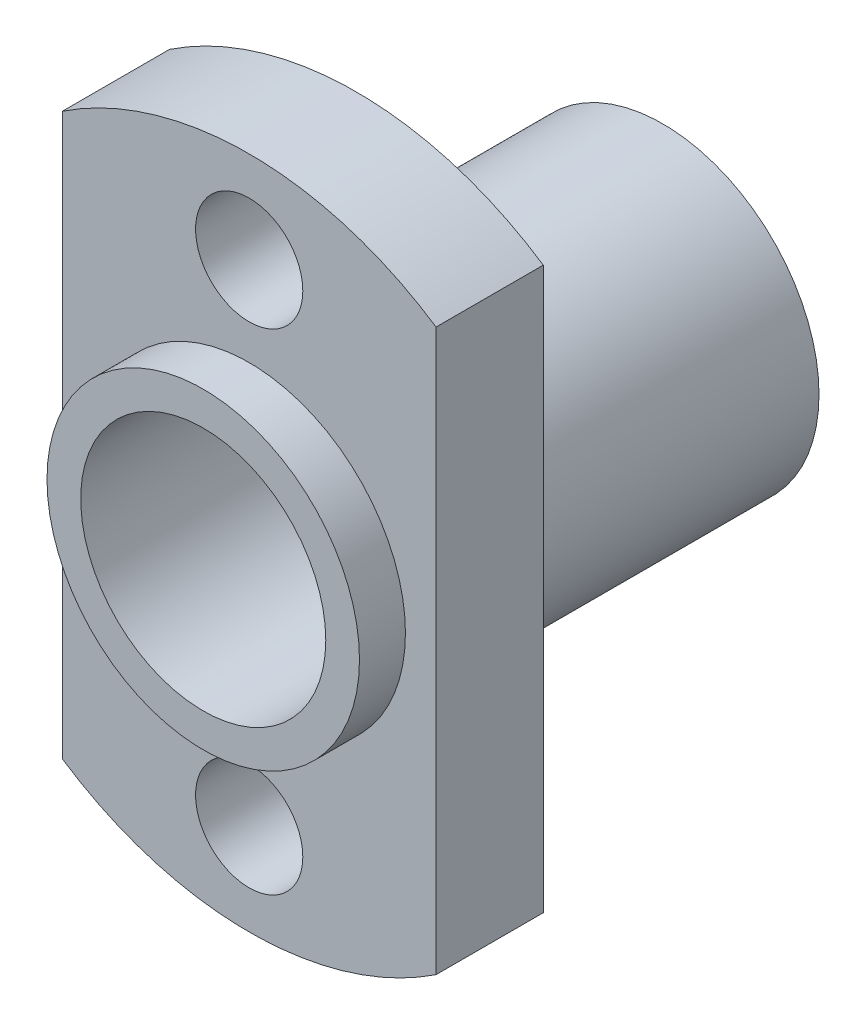
ISO-10303-21;
HEADER;
FILE_DESCRIPTION(('STEP AP214'),'2;1');
FILE_NAME('part.step','',(''),(''),'','','');
FILE_SCHEMA(('AUTOMOTIVE_DESIGN { 1 0 10303 214 1 1 1 1 }'));
ENDSEC;
DATA;
#1=APPLICATION_CONTEXT('core data for automotive mechanical design processes');
#2=APPLICATION_PROTOCOL_DEFINITION('international standard','automotive_design',2000,#1);
#3=PRODUCT_CONTEXT('',#1,'mechanical');
#4=PRODUCT('Part','Part','',(#3));
#5=PRODUCT_RELATED_PRODUCT_CATEGORY('part','',(#4));
#6=PRODUCT_DEFINITION_FORMATION('','',#4);
#7=PRODUCT_DEFINITION_CONTEXT('part definition',#1,'design');
#8=PRODUCT_DEFINITION('design','',#6,#7);
#9=PRODUCT_DEFINITION_SHAPE('','',#8);
#10=(LENGTH_UNIT() NAMED_UNIT(*) SI_UNIT(.MILLI.,.METRE.));
#11=(NAMED_UNIT(*) PLANE_ANGLE_UNIT() SI_UNIT($,.RADIAN.));
#12=(NAMED_UNIT(*) SI_UNIT($,.STERADIAN.) SOLID_ANGLE_UNIT());
#13=UNCERTAINTY_MEASURE_WITH_UNIT(LENGTH_MEASURE(1.E-05),#10,'distance_accuracy_value','');
#14=(GEOMETRIC_REPRESENTATION_CONTEXT(3) GLOBAL_UNCERTAINTY_ASSIGNED_CONTEXT((#13)) GLOBAL_UNIT_ASSIGNED_CONTEXT((#10,
#11,#12)) REPRESENTATION_CONTEXT('',''));
#15=CARTESIAN_POINT('',(0.,0.,0.));
#16=DIRECTION('',(0.,0.,1.));
#17=DIRECTION('',(1.,0.,0.));
#18=AXIS2_PLACEMENT_3D('',#15,#16,#17);
#19=CARTESIAN_POINT('',(0.,0.,-3.5));
#20=DIRECTION('',(0.,0.,1.));
#21=DIRECTION('',(1.,0.,0.));
#22=AXIS2_PLACEMENT_3D('',#19,#20,#21);
#23=CYLINDRICAL_SURFACE('',#22,11.);
#24=CARTESIAN_POINT('',(0.,0.,0.));
#25=DIRECTION('',(0.,0.,1.));
#26=DIRECTION('',(1.,0.,0.));
#27=AXIS2_PLACEMENT_3D('',#24,#25,#26);
#28=CIRCLE('',#27,11.);
#29=CARTESIAN_POINT('',(-6.1,-9.15368778143541,0.));
#30=VERTEX_POINT('',#29);
#31=CARTESIAN_POINT('',(6.1,-9.15368778143541,0.));
#32=VERTEX_POINT('',#31);
#33=EDGE_CURVE('E97',#30,#32,#28,.T.);
#34=ORIENTED_EDGE('',*,*,#33,.F.);
#35=DIRECTION('',(0.,0.,1.));
#36=VECTOR('',#35,1.);
#37=CARTESIAN_POINT('',(-6.1,-9.15368778143541,-3.5));
#38=LINE('',#37,#36);
#39=CARTESIAN_POINT('',(-6.1,-9.15368778143541,-3.5));
#40=VERTEX_POINT('',#39);
#41=EDGE_CURVE('E11',#40,#30,#38,.T.);
#42=ORIENTED_EDGE('',*,*,#41,.F.);
#43=CARTESIAN_POINT('',(0.,0.,-3.5));
#44=DIRECTION('',(0.,0.,1.));
#45=DIRECTION('',(1.,0.,0.));
#46=AXIS2_PLACEMENT_3D('',#43,#44,#45);
#47=CIRCLE('',#46,11.);
#48=CARTESIAN_POINT('',(6.1,-9.15368778143541,-3.5));
#49=VERTEX_POINT('',#48);
#50=EDGE_CURVE('E90',#40,#49,#47,.T.);
#51=ORIENTED_EDGE('',*,*,#50,.T.);
#52=DIRECTION('',(0.,0.,1.));
#53=VECTOR('',#52,1.);
#54=CARTESIAN_POINT('',(6.1,-9.15368778143541,-3.5));
#55=LINE('',#54,#53);
#56=EDGE_CURVE('E35',#49,#32,#55,.T.);
#57=ORIENTED_EDGE('',*,*,#56,.T.);
#58=EDGE_LOOP('',(#34,#42,#51,#57));
#59=FACE_BOUND('',#58,.T.);
#60=ADVANCED_FACE('F32',(#59),#23,.T.);
#61=CARTESIAN_POINT('',(-6.1,-9.15368778143541,-3.5));
#62=DIRECTION('',(-1.,0.,0.));
#63=DIRECTION('',(0.,0.,1.));
#64=AXIS2_PLACEMENT_3D('',#61,#62,#63);
#65=PLANE('',#64);
#66=DIRECTION('',(0.,-1.,0.));
#67=VECTOR('',#66,1.);
#68=CARTESIAN_POINT('',(-6.1,-9.15368778143541,0.));
#69=LINE('',#68,#67);
#70=CARTESIAN_POINT('',(-6.1,9.15368778143541,0.));
#71=VERTEX_POINT('',#70);
#72=EDGE_CURVE('E92',#71,#30,#69,.T.);
#73=ORIENTED_EDGE('',*,*,#72,.F.);
#74=DIRECTION('',(0.,0.,1.));
#75=VECTOR('',#74,1.);
#76=CARTESIAN_POINT('',(-6.1,9.15368778143541,-3.5));
#77=LINE('',#76,#75);
#78=CARTESIAN_POINT('',(-6.1,9.15368778143541,-3.5));
#79=VERTEX_POINT('',#78);
#80=EDGE_CURVE('E41',#79,#71,#77,.T.);
#81=ORIENTED_EDGE('',*,*,#80,.F.);
#82=DIRECTION('',(0.,-1.,0.));
#83=VECTOR('',#82,1.);
#84=CARTESIAN_POINT('',(-6.1,-9.15368778143541,-3.5));
#85=LINE('',#84,#83);
#86=EDGE_CURVE('E87',#79,#40,#85,.T.);
#87=ORIENTED_EDGE('',*,*,#86,.T.);
#88=ORIENTED_EDGE('',*,*,#41,.T.);
#89=EDGE_LOOP('',(#73,#81,#87,#88));
#90=FACE_BOUND('',#89,.T.);
#91=ADVANCED_FACE('F108',(#90),#65,.T.);
#92=CARTESIAN_POINT('',(0.,0.,-3.5));
#93=DIRECTION('',(0.,0.,1.));
#94=DIRECTION('',(1.,0.,0.));
#95=AXIS2_PLACEMENT_3D('',#92,#93,#94);
#96=CYLINDRICAL_SURFACE('',#95,11.);
#97=CARTESIAN_POINT('',(0.,0.,0.));
#98=DIRECTION('',(0.,0.,1.));
#99=DIRECTION('',(1.,0.,0.));
#100=AXIS2_PLACEMENT_3D('',#97,#98,#99);
#101=CIRCLE('',#100,11.);
#102=CARTESIAN_POINT('',(6.1,9.15368778143541,0.));
#103=VERTEX_POINT('',#102);
#104=EDGE_CURVE('E82',#103,#71,#101,.T.);
#105=ORIENTED_EDGE('',*,*,#104,.F.);
#106=DIRECTION('',(0.,0.,1.));
#107=VECTOR('',#106,1.);
#108=CARTESIAN_POINT('',(6.1,9.15368778143541,-3.5));
#109=LINE('',#108,#107);
#110=CARTESIAN_POINT('',(6.1,9.15368778143541,-3.5));
#111=VERTEX_POINT('',#110);
#112=EDGE_CURVE('E77',#111,#103,#109,.T.);
#113=ORIENTED_EDGE('',*,*,#112,.F.);
#114=CARTESIAN_POINT('',(0.,0.,-3.5));
#115=DIRECTION('',(0.,0.,1.));
#116=DIRECTION('',(1.,0.,0.));
#117=AXIS2_PLACEMENT_3D('',#114,#115,#116);
#118=CIRCLE('',#117,11.);
#119=EDGE_CURVE('E80',#111,#79,#118,.T.);
#120=ORIENTED_EDGE('',*,*,#119,.T.);
#121=ORIENTED_EDGE('',*,*,#80,.T.);
#122=EDGE_LOOP('',(#105,#113,#120,#121));
#123=FACE_BOUND('',#122,.T.);
#124=ADVANCED_FACE('F79',(#123),#96,.T.);
#125=CARTESIAN_POINT('',(6.1,-9.15368778143541,-3.5));
#126=DIRECTION('',(1.,0.,0.));
#127=DIRECTION('',(0.,0.,-1.));
#128=AXIS2_PLACEMENT_3D('',#125,#126,#127);
#129=PLANE('',#128);
#130=DIRECTION('',(0.,1.,0.));
#131=VECTOR('',#130,1.);
#132=CARTESIAN_POINT('',(6.1,-9.15368778143541,0.));
#133=LINE('',#132,#131);
#134=EDGE_CURVE('E100',#32,#103,#133,.T.);
#135=ORIENTED_EDGE('',*,*,#134,.F.);
#136=ORIENTED_EDGE('',*,*,#56,.F.);
#137=DIRECTION('',(0.,1.,0.));
#138=VECTOR('',#137,1.);
#139=CARTESIAN_POINT('',(6.1,-9.15368778143541,-3.5));
#140=LINE('',#139,#138);
#141=EDGE_CURVE('E86',#49,#111,#140,.T.);
#142=ORIENTED_EDGE('',*,*,#141,.T.);
#143=ORIENTED_EDGE('',*,*,#112,.T.);
#144=EDGE_LOOP('',(#135,#136,#142,#143));
#145=FACE_BOUND('',#144,.T.);
#146=ADVANCED_FACE('F89',(#145),#129,.T.);
#147=CARTESIAN_POINT('',(0.,0.,-3.5));
#148=DIRECTION('',(0.,0.,1.));
#149=DIRECTION('',(1.,0.,0.));
#150=AXIS2_PLACEMENT_3D('',#147,#148,#149);
#151=PLANE('',#150);
#152=CARTESIAN_POINT('',(4.52787916007828E-13,-8.,-3.5));
#153=DIRECTION('',(0.,0.,1.));
#154=DIRECTION('',(1.,0.,0.));
#155=AXIS2_PLACEMENT_3D('',#152,#153,#154);
#156=CIRCLE('',#155,1.75000000000049);
#157=CARTESIAN_POINT('',(1.75000000000094,-8.,-3.5));
#158=VERTEX_POINT('',#157);
#159=EDGE_CURVE('E177',#158,#158,#156,.T.);
#160=ORIENTED_EDGE('',*,*,#159,.T.);
#161=EDGE_LOOP('',(#160));
#162=FACE_BOUND('',#161,.T.);
#163=CARTESIAN_POINT('',(0.,8.,-3.5));
#164=DIRECTION('',(0.,0.,1.));
#165=DIRECTION('',(1.,0.,0.));
#166=AXIS2_PLACEMENT_3D('',#163,#164,#165);
#167=CIRCLE('',#166,1.75);
#168=CARTESIAN_POINT('',(1.75,8.,-3.5));
#169=VERTEX_POINT('',#168);
#170=EDGE_CURVE('E182',#169,#169,#167,.T.);
#171=ORIENTED_EDGE('',*,*,#170,.T.);
#172=EDGE_LOOP('',(#171));
#173=FACE_BOUND('',#172,.T.);
#174=CARTESIAN_POINT('',(0.,0.,-3.5));
#175=DIRECTION('',(0.,0.,1.));
#176=DIRECTION('',(1.,0.,0.));
#177=AXIS2_PLACEMENT_3D('',#174,#175,#176);
#178=CIRCLE('',#177,5.1);
#179=CARTESIAN_POINT('',(5.1,0.,-3.5));
#180=VERTEX_POINT('',#179);
#181=EDGE_CURVE('E173',#180,#180,#178,.T.);
#182=ORIENTED_EDGE('',*,*,#181,.T.);
#183=EDGE_LOOP('',(#182));
#184=FACE_BOUND('',#183,.T.);
#185=ORIENTED_EDGE('',*,*,#50,.F.);
#186=ORIENTED_EDGE('',*,*,#86,.F.);
#187=ORIENTED_EDGE('',*,*,#119,.F.);
#188=ORIENTED_EDGE('',*,*,#141,.F.);
#189=EDGE_LOOP('',(#185,#186,#187,#188));
#190=FACE_BOUND('',#189,.T.);
#191=ADVANCED_FACE('F85',(#162,#173,#184,#190),#151,.F.);
#192=CARTESIAN_POINT('',(0.,0.,0.));
#193=DIRECTION('',(0.,0.,1.));
#194=DIRECTION('',(1.,0.,0.));
#195=AXIS2_PLACEMENT_3D('',#192,#193,#194);
#196=PLANE('',#195);
#197=CARTESIAN_POINT('',(4.52787916007828E-13,-8.,0.));
#198=DIRECTION('',(0.,0.,1.));
#199=DIRECTION('',(1.,0.,0.));
#200=AXIS2_PLACEMENT_3D('',#197,#198,#199);
#201=CIRCLE('',#200,1.75000000000049);
#202=CARTESIAN_POINT('',(1.75000000000094,-8.,0.));
#203=VERTEX_POINT('',#202);
#204=EDGE_CURVE('E176',#203,#203,#201,.T.);
#205=ORIENTED_EDGE('',*,*,#204,.F.);
#206=EDGE_LOOP('',(#205));
#207=FACE_BOUND('',#206,.T.);
#208=CARTESIAN_POINT('',(0.,8.,0.));
#209=DIRECTION('',(0.,0.,1.));
#210=DIRECTION('',(1.,0.,0.));
#211=AXIS2_PLACEMENT_3D('',#208,#209,#210);
#212=CIRCLE('',#211,1.75);
#213=CARTESIAN_POINT('',(1.75,8.,0.));
#214=VERTEX_POINT('',#213);
#215=EDGE_CURVE('E179',#214,#214,#212,.T.);
#216=ORIENTED_EDGE('',*,*,#215,.F.);
#217=EDGE_LOOP('',(#216));
#218=FACE_BOUND('',#217,.T.);
#219=CARTESIAN_POINT('',(0.,0.,0.));
#220=DIRECTION('',(0.,0.,1.));
#221=DIRECTION('',(1.,0.,0.));
#222=AXIS2_PLACEMENT_3D('',#219,#220,#221);
#223=CIRCLE('',#222,5.1);
#224=CARTESIAN_POINT('',(5.1,0.,0.));
#225=VERTEX_POINT('',#224);
#226=EDGE_CURVE('E101',#225,#225,#223,.T.);
#227=ORIENTED_EDGE('',*,*,#226,.F.);
#228=EDGE_LOOP('',(#227));
#229=FACE_BOUND('',#228,.T.);
#230=ORIENTED_EDGE('',*,*,#33,.T.);
#231=ORIENTED_EDGE('',*,*,#134,.T.);
#232=ORIENTED_EDGE('',*,*,#104,.T.);
#233=ORIENTED_EDGE('',*,*,#72,.T.);
#234=EDGE_LOOP('',(#230,#231,#232,#233));
#235=FACE_BOUND('',#234,.T.);
#236=ADVANCED_FACE('F107',(#207,#218,#229,#235),#196,.T.);
#237=CARTESIAN_POINT('',(0.,8.,-3.5));
#238=DIRECTION('',(0.,0.,1.));
#239=DIRECTION('',(1.,0.,0.));
#240=AXIS2_PLACEMENT_3D('',#237,#238,#239);
#241=CYLINDRICAL_SURFACE('',#240,1.75);
#242=ORIENTED_EDGE('',*,*,#170,.F.);
#243=EDGE_LOOP('',(#242));
#244=FACE_BOUND('',#243,.T.);
#245=ORIENTED_EDGE('',*,*,#215,.T.);
#246=EDGE_LOOP('',(#245));
#247=FACE_BOUND('',#246,.T.);
#248=ADVANCED_FACE('F126',(#244,#247),#241,.F.);
#249=CARTESIAN_POINT('',(4.52787916007828E-13,-8.,-3.5));
#250=DIRECTION('',(0.,0.,1.));
#251=DIRECTION('',(1.,0.,0.));
#252=AXIS2_PLACEMENT_3D('',#249,#250,#251);
#253=CYLINDRICAL_SURFACE('',#252,1.75000000000049);
#254=ORIENTED_EDGE('',*,*,#159,.F.);
#255=EDGE_LOOP('',(#254));
#256=FACE_BOUND('',#255,.T.);
#257=ORIENTED_EDGE('',*,*,#204,.T.);
#258=EDGE_LOOP('',(#257));
#259=FACE_BOUND('',#258,.T.);
#260=ADVANCED_FACE('F133',(#256,#259),#253,.F.);
#261=CARTESIAN_POINT('',(0.,0.,-13.5));
#262=DIRECTION('',(0.,0.,1.));
#263=DIRECTION('',(1.,0.,0.));
#264=AXIS2_PLACEMENT_3D('',#261,#262,#263);
#265=CYLINDRICAL_SURFACE('',#264,5.1);
#266=CARTESIAN_POINT('',(0.,0.,-13.5));
#267=DIRECTION('',(0.,0.,1.));
#268=DIRECTION('',(1.,0.,0.));
#269=AXIS2_PLACEMENT_3D('',#266,#267,#268);
#270=CIRCLE('',#269,5.1);
#271=CARTESIAN_POINT('',(5.1,0.,-13.5));
#272=VERTEX_POINT('',#271);
#273=EDGE_CURVE('E170',#272,#272,#270,.T.);
#274=ORIENTED_EDGE('',*,*,#273,.T.);
#275=EDGE_LOOP('',(#274));
#276=FACE_BOUND('',#275,.T.);
#277=ORIENTED_EDGE('',*,*,#181,.F.);
#278=EDGE_LOOP('',(#277));
#279=FACE_BOUND('',#278,.T.);
#280=ADVANCED_FACE('F137',(#276,#279),#265,.T.);
#281=ORIENTED_EDGE('',*,*,#226,.T.);
#282=EDGE_LOOP('',(#281));
#283=FACE_BOUND('',#282,.T.);
#284=CARTESIAN_POINT('',(0.,0.,1.5));
#285=DIRECTION('',(0.,0.,1.));
#286=DIRECTION('',(1.,0.,0.));
#287=AXIS2_PLACEMENT_3D('',#284,#285,#286);
#288=CIRCLE('',#287,5.1);
#289=CARTESIAN_POINT('',(5.1,0.,1.5));
#290=VERTEX_POINT('',#289);
#291=EDGE_CURVE('E159',#290,#290,#288,.T.);
#292=ORIENTED_EDGE('',*,*,#291,.F.);
#293=EDGE_LOOP('',(#292));
#294=FACE_BOUND('',#293,.T.);
#295=ADVANCED_FACE('F139',(#283,#294),#265,.T.);
#296=CARTESIAN_POINT('',(0.,0.,-13.5));
#297=DIRECTION('',(0.,0.,1.));
#298=DIRECTION('',(1.,0.,0.));
#299=AXIS2_PLACEMENT_3D('',#296,#297,#298);
#300=PLANE('',#299);
#301=CARTESIAN_POINT('',(0.,0.,-13.5));
#302=DIRECTION('',(0.,0.,1.));
#303=DIRECTION('',(1.,0.,0.));
#304=AXIS2_PLACEMENT_3D('',#301,#302,#303);
#305=CIRCLE('',#304,4.);
#306=CARTESIAN_POINT('',(4.,0.,-13.5));
#307=VERTEX_POINT('',#306);
#308=EDGE_CURVE('E165',#307,#307,#305,.T.);
#309=ORIENTED_EDGE('',*,*,#308,.T.);
#310=EDGE_LOOP('',(#309));
#311=FACE_BOUND('',#310,.T.);
#312=ORIENTED_EDGE('',*,*,#273,.F.);
#313=EDGE_LOOP('',(#312));
#314=FACE_BOUND('',#313,.T.);
#315=ADVANCED_FACE('F142',(#311,#314),#300,.F.);
#316=CARTESIAN_POINT('',(0.,0.,-13.5));
#317=DIRECTION('',(0.,0.,1.));
#318=DIRECTION('',(1.,0.,0.));
#319=AXIS2_PLACEMENT_3D('',#316,#317,#318);
#320=CYLINDRICAL_SURFACE('',#319,4.);
#321=ORIENTED_EDGE('',*,*,#308,.F.);
#322=EDGE_LOOP('',(#321));
#323=FACE_BOUND('',#322,.T.);
#324=CARTESIAN_POINT('',(0.,0.,1.5));
#325=DIRECTION('',(0.,0.,1.));
#326=DIRECTION('',(1.,0.,0.));
#327=AXIS2_PLACEMENT_3D('',#324,#325,#326);
#328=CIRCLE('',#327,4.);
#329=CARTESIAN_POINT('',(4.,0.,1.5));
#330=VERTEX_POINT('',#329);
#331=EDGE_CURVE('E162',#330,#330,#328,.T.);
#332=ORIENTED_EDGE('',*,*,#331,.T.);
#333=EDGE_LOOP('',(#332));
#334=FACE_BOUND('',#333,.T.);
#335=ADVANCED_FACE('F146',(#323,#334),#320,.F.);
#336=CARTESIAN_POINT('',(0.,0.,1.5));
#337=DIRECTION('',(0.,0.,1.));
#338=DIRECTION('',(1.,0.,0.));
#339=AXIS2_PLACEMENT_3D('',#336,#337,#338);
#340=PLANE('',#339);
#341=ORIENTED_EDGE('',*,*,#291,.T.);
#342=EDGE_LOOP('',(#341));
#343=FACE_BOUND('',#342,.T.);
#344=ORIENTED_EDGE('',*,*,#331,.F.);
#345=EDGE_LOOP('',(#344));
#346=FACE_BOUND('',#345,.T.);
#347=ADVANCED_FACE('F150',(#343,#346),#340,.T.);
#348=CLOSED_SHELL('',(#60,#91,#124,#146,#191,#236,#248,#260,#280,#295,#315,#335,#347));
#349=MANIFOLD_SOLID_BREP('B2',#348);
#350=ADVANCED_BREP_SHAPE_REPRESENTATION('',(#18,#349),#14);
#351=SHAPE_DEFINITION_REPRESENTATION(#9,#350);
ENDSEC;
END-ISO-10303-21;
